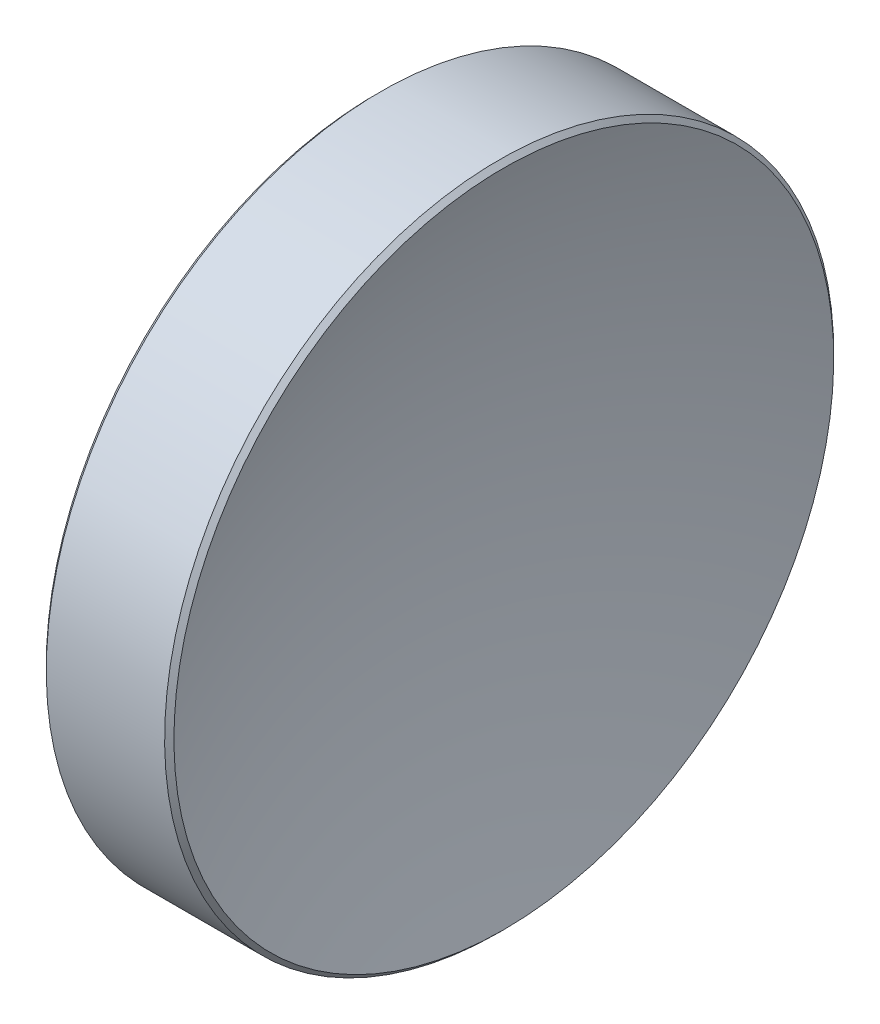
ISO-10303-21;
HEADER;
FILE_DESCRIPTION(('STEP AP214'),'2;1');
FILE_NAME('part.step','',(''),(''),'','','');
FILE_SCHEMA(('AUTOMOTIVE_DESIGN { 1 0 10303 214 1 1 1 1 }'));
ENDSEC;
DATA;
#1=APPLICATION_CONTEXT('core data for automotive mechanical design processes');
#2=APPLICATION_PROTOCOL_DEFINITION('international standard','automotive_design',2000,#1);
#3=PRODUCT_CONTEXT('',#1,'mechanical');
#4=PRODUCT('Part','Part','',(#3));
#5=PRODUCT_RELATED_PRODUCT_CATEGORY('part','',(#4));
#6=PRODUCT_DEFINITION_FORMATION('','',#4);
#7=PRODUCT_DEFINITION_CONTEXT('part definition',#1,'design');
#8=PRODUCT_DEFINITION('design','',#6,#7);
#9=PRODUCT_DEFINITION_SHAPE('','',#8);
#10=(LENGTH_UNIT() NAMED_UNIT(*) SI_UNIT(.MILLI.,.METRE.));
#11=(NAMED_UNIT(*) PLANE_ANGLE_UNIT() SI_UNIT($,.RADIAN.));
#12=(NAMED_UNIT(*) SI_UNIT($,.STERADIAN.) SOLID_ANGLE_UNIT());
#13=UNCERTAINTY_MEASURE_WITH_UNIT(LENGTH_MEASURE(1.E-05),#10,'distance_accuracy_value','');
#14=(GEOMETRIC_REPRESENTATION_CONTEXT(3) GLOBAL_UNCERTAINTY_ASSIGNED_CONTEXT((#13)) GLOBAL_UNIT_ASSIGNED_CONTEXT((#10,
#11,#12)) REPRESENTATION_CONTEXT('',''));
#15=CARTESIAN_POINT('',(0.,0.,0.));
#16=DIRECTION('',(0.,0.,1.));
#17=DIRECTION('',(1.,0.,0.));
#18=AXIS2_PLACEMENT_3D('',#15,#16,#17);
#19=CARTESIAN_POINT('',(148.498694282833,-0.625870150386287,0.));
#20=DIRECTION('',(0.,0.,-1.));
#21=DIRECTION('',(0.,-1.,0.));
#22=AXIS2_PLACEMENT_3D('',#19,#20,#21);
#23=CIRCLE('',#22,150.);
#24=TRIMMED_CURVE('',#23,(PARAMETER_VALUE(-1.57496880657099)),
(PARAMETER_VALUE(1.57496880657099)),.T.,.PARAMETER.);
#25=CARTESIAN_POINT('',(148.498694282833,0.,0.));
#26=DIRECTION('',(-1.,0.,0.));
#27=AXIS1_PLACEMENT('',#25,#26);
#28=SURFACE_OF_REVOLUTION('',#24,#27);
#29=CARTESIAN_POINT('',(-1.5,0.,0.));
#30=VERTEX_POINT('',#29);
#31=VERTEX_LOOP('',#30);
#32=FACE_BOUND('',#31,.T.);
#33=CARTESIAN_POINT('',(-1.02873794256636,0.,0.));
#34=DIRECTION('',(-1.,0.,0.));
#35=DIRECTION('',(0.,-1.,0.));
#36=AXIS2_PLACEMENT_3D('',#33,#34,#35);
#37=CIRCLE('',#36,12.5232233047034);
#38=CARTESIAN_POINT('',(-1.02873794256636,-12.5232233047034,0.));
#39=VERTEX_POINT('',#38);
#40=EDGE_CURVE('E10',#39,#39,#37,.T.);
#41=ORIENTED_EDGE('',*,*,#40,.T.);
#42=EDGE_LOOP('',(#41));
#43=FACE_BOUND('',#42,.T.);
#44=ADVANCED_FACE('F15',(#32,#43),#28,.T.);
#45=CARTESIAN_POINT('',(-0.851961247269721,0.,0.));
#46=DIRECTION('',(1.,0.,0.));
#47=DIRECTION('',(0.,1.,0.));
#48=AXIS2_PLACEMENT_3D('',#45,#46,#47);
#49=CONICAL_SURFACE('',#48,12.7,0.785398163397443);
#50=ORIENTED_EDGE('',*,*,#40,.F.);
#51=EDGE_LOOP('',(#50));
#52=FACE_BOUND('',#51,.T.);
#53=CARTESIAN_POINT('',(-0.851961247269721,0.,0.));
#54=DIRECTION('',(-1.,0.,0.));
#55=DIRECTION('',(0.,-1.,0.));
#56=AXIS2_PLACEMENT_3D('',#53,#54,#55);
#57=CIRCLE('',#56,12.7);
#58=CARTESIAN_POINT('',(-0.851961247269719,-12.7,0.));
#59=VERTEX_POINT('',#58);
#60=EDGE_CURVE('E21',#59,#59,#57,.T.);
#61=ORIENTED_EDGE('',*,*,#60,.T.);
#62=EDGE_LOOP('',(#61));
#63=FACE_BOUND('',#62,.T.);
#64=ADVANCED_FACE('F26',(#52,#63),#49,.T.);
#65=CARTESIAN_POINT('',(-1.5,0.,0.));
#66=DIRECTION('',(-1.,0.,0.));
#67=DIRECTION('',(0.,-1.,0.));
#68=AXIS2_PLACEMENT_3D('',#65,#66,#67);
#69=CYLINDRICAL_SURFACE('',#68,12.7);
#70=ORIENTED_EDGE('',*,*,#60,.F.);
#71=EDGE_LOOP('',(#70));
#72=FACE_BOUND('',#71,.T.);
#73=CARTESIAN_POINT('',(3.64037033773406,0.,0.));
#74=DIRECTION('',(-1.,0.,0.));
#75=DIRECTION('',(0.,-1.,0.));
#76=AXIS2_PLACEMENT_3D('',#73,#74,#75);
#77=CIRCLE('',#76,12.7);
#78=CARTESIAN_POINT('',(3.64037033773407,-12.7,0.));
#79=VERTEX_POINT('',#78);
#80=EDGE_CURVE('E35',#79,#79,#77,.T.);
#81=ORIENTED_EDGE('',*,*,#80,.T.);
#82=EDGE_LOOP('',(#81));
#83=FACE_BOUND('',#82,.T.);
#84=ADVANCED_FACE('F31',(#72,#83),#69,.T.);
#85=CARTESIAN_POINT('',(3.81714703303069,0.,0.));
#86=DIRECTION('',(-1.,0.,0.));
#87=DIRECTION('',(0.,-1.,0.));
#88=AXIS2_PLACEMENT_3D('',#85,#86,#87);
#89=CONICAL_SURFACE('',#88,12.5232233047034,0.785398163397453);
#90=ORIENTED_EDGE('',*,*,#80,.F.);
#91=EDGE_LOOP('',(#90));
#92=FACE_BOUND('',#91,.T.);
#93=CARTESIAN_POINT('',(3.81714703303069,0.,0.));
#94=DIRECTION('',(-1.,0.,0.));
#95=DIRECTION('',(0.,-1.,0.));
#96=AXIS2_PLACEMENT_3D('',#93,#94,#95);
#97=CIRCLE('',#96,12.5232233047034);
#98=CARTESIAN_POINT('',(3.81714703303069,-12.5232233047034,0.));
#99=VERTEX_POINT('',#98);
#100=EDGE_CURVE('E37',#99,#99,#97,.T.);
#101=ORIENTED_EDGE('',*,*,#100,.T.);
#102=EDGE_LOOP('',(#101));
#103=FACE_BOUND('',#102,.T.);
#104=ADVANCED_FACE('F43',(#92,#103),#89,.T.);
#105=CARTESIAN_POINT('',(36.5,0.,0.));
#106=DIRECTION('',(-1.,0.,0.));
#107=DIRECTION('',(0.,-1.,0.));
#108=AXIS2_PLACEMENT_3D('',#105,#106,#107);
#109=SPHERICAL_SURFACE('',#108,35.);
#110=ORIENTED_EDGE('',*,*,#100,.F.);
#111=EDGE_LOOP('',(#110));
#112=FACE_BOUND('',#111,.T.);
#113=ADVANCED_FACE('F45',(#112),#109,.F.);
#114=CLOSED_SHELL('',(#44,#64,#84,#104,#113));
#115=MANIFOLD_SOLID_BREP('B1',#114);
#116=ADVANCED_BREP_SHAPE_REPRESENTATION('',(#18,#115),#14);
#117=SHAPE_DEFINITION_REPRESENTATION(#9,#116);
ENDSEC;
END-ISO-10303-21;
